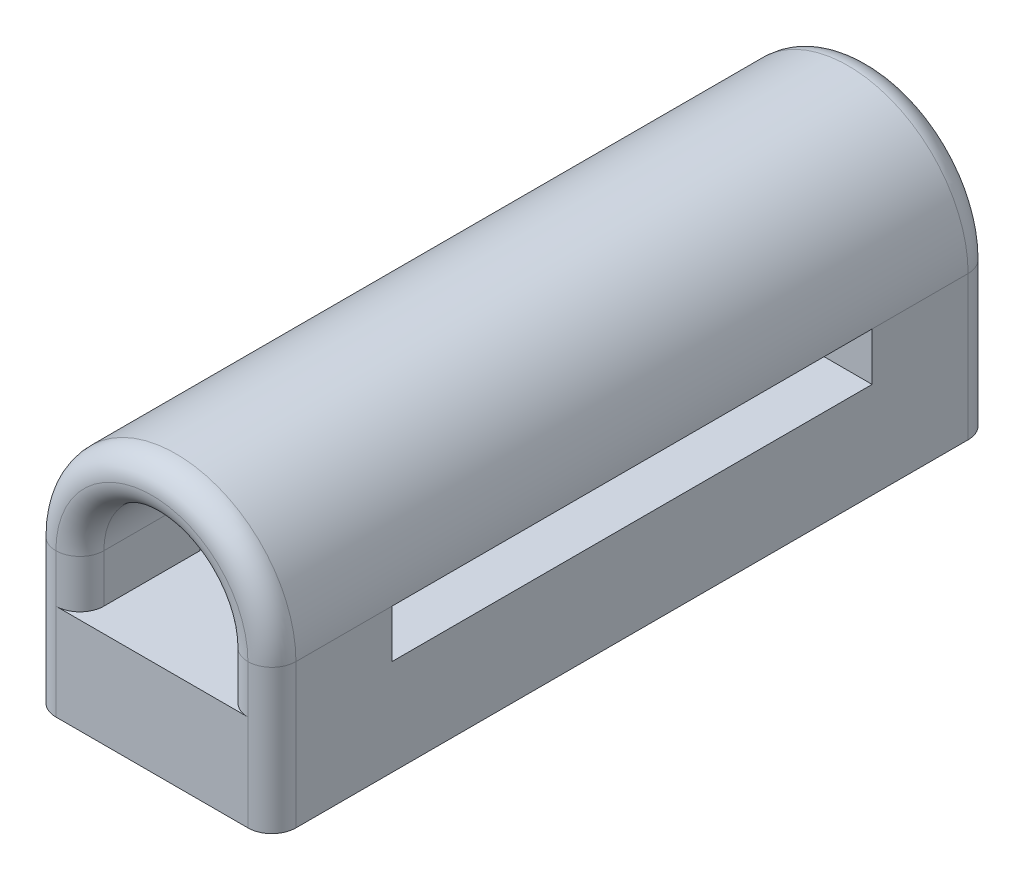
ISO-10303-21;
HEADER;
FILE_DESCRIPTION(('STEP AP214'),'2;1');
FILE_NAME('part.step','',(''),(''),'','','');
FILE_SCHEMA(('AUTOMOTIVE_DESIGN { 1 0 10303 214 1 1 1 1 }'));
ENDSEC;
DATA;
#1=APPLICATION_CONTEXT('core data for automotive mechanical design processes');
#2=APPLICATION_PROTOCOL_DEFINITION('international standard','automotive_design',2000,#1);
#3=PRODUCT_CONTEXT('',#1,'mechanical');
#4=PRODUCT('Part','Part','',(#3));
#5=PRODUCT_RELATED_PRODUCT_CATEGORY('part','',(#4));
#6=PRODUCT_DEFINITION_FORMATION('','',#4);
#7=PRODUCT_DEFINITION_CONTEXT('part definition',#1,'design');
#8=PRODUCT_DEFINITION('design','',#6,#7);
#9=PRODUCT_DEFINITION_SHAPE('','',#8);
#10=(LENGTH_UNIT() NAMED_UNIT(*) SI_UNIT(.MILLI.,.METRE.));
#11=(NAMED_UNIT(*) PLANE_ANGLE_UNIT() SI_UNIT($,.RADIAN.));
#12=(NAMED_UNIT(*) SI_UNIT($,.STERADIAN.) SOLID_ANGLE_UNIT());
#13=UNCERTAINTY_MEASURE_WITH_UNIT(LENGTH_MEASURE(1.E-05),#10,'distance_accuracy_value','');
#14=(GEOMETRIC_REPRESENTATION_CONTEXT(3) GLOBAL_UNCERTAINTY_ASSIGNED_CONTEXT((#13)) GLOBAL_UNIT_ASSIGNED_CONTEXT((#10,
#11,#12)) REPRESENTATION_CONTEXT('',''));
#15=CARTESIAN_POINT('',(0.,0.,0.));
#16=DIRECTION('',(0.,0.,1.));
#17=DIRECTION('',(1.,0.,0.));
#18=AXIS2_PLACEMENT_3D('',#15,#16,#17);
#19=CARTESIAN_POINT('',(-1.5,-3.,15.));
#20=DIRECTION('',(-1.,0.,0.));
#21=DIRECTION('',(0.,0.,1.));
#22=AXIS2_PLACEMENT_3D('',#19,#20,#21);
#23=PLANE('',#22);
#24=DIRECTION('',(0.,0.,1.));
#25=VECTOR('',#24,1.);
#26=CARTESIAN_POINT('',(-1.5,-1.,15.));
#27=LINE('',#26,#25);
#28=CARTESIAN_POINT('',(-1.5,-1.,0.5));
#29=VERTEX_POINT('',#28);
#30=CARTESIAN_POINT('',(-1.5,-1.,2.5));
#31=VERTEX_POINT('',#30);
#32=EDGE_CURVE('E162',#29,#31,#27,.T.);
#33=ORIENTED_EDGE('',*,*,#32,.F.);
#34=DIRECTION('',(0.,1.,0.));
#35=VECTOR('',#34,1.);
#36=CARTESIAN_POINT('',(-1.5,-3.,0.5));
#37=LINE('',#36,#35);
#38=CARTESIAN_POINT('',(-1.5,0.,0.5));
#39=VERTEX_POINT('',#38);
#40=EDGE_CURVE('E358',#29,#39,#37,.T.);
#41=ORIENTED_EDGE('',*,*,#40,.T.);
#42=DIRECTION('',(0.,0.,1.));
#43=VECTOR('',#42,1.);
#44=CARTESIAN_POINT('',(-1.5,0.,0.));
#45=LINE('',#44,#43);
#46=CARTESIAN_POINT('',(-1.5,0.,2.5));
#47=VERTEX_POINT('',#46);
#48=EDGE_CURVE('E207',#39,#47,#45,.T.);
#49=ORIENTED_EDGE('',*,*,#48,.T.);
#50=DIRECTION('',(0.,1.,0.));
#51=VECTOR('',#50,1.);
#52=CARTESIAN_POINT('',(-1.5,-3.,2.5));
#53=LINE('',#52,#51);
#54=EDGE_CURVE('E219',#31,#47,#53,.T.);
#55=ORIENTED_EDGE('',*,*,#54,.F.);
#56=EDGE_LOOP('',(#33,#41,#49,#55));
#57=FACE_BOUND('',#56,.T.);
#58=ADVANCED_FACE('F41',(#57),#23,.F.);
#59=DIRECTION('',(0.,0.,-1.));
#60=VECTOR('',#59,1.);
#61=CARTESIAN_POINT('',(-1.5,0.,15.));
#62=LINE('',#61,#60);
#63=CARTESIAN_POINT('',(-1.5,0.,14.5));
#64=VERTEX_POINT('',#63);
#65=CARTESIAN_POINT('',(-1.5,0.,12.5));
#66=VERTEX_POINT('',#65);
#67=EDGE_CURVE('E300',#64,#66,#62,.T.);
#68=ORIENTED_EDGE('',*,*,#67,.F.);
#69=DIRECTION('',(0.,1.,0.));
#70=VECTOR('',#69,1.);
#71=CARTESIAN_POINT('',(-1.5,-1.,14.5));
#72=LINE('',#71,#70);
#73=CARTESIAN_POINT('',(-1.5,-1.,14.5));
#74=VERTEX_POINT('',#73);
#75=EDGE_CURVE('E366',#64,#74,#72,.F.);
#76=ORIENTED_EDGE('',*,*,#75,.T.);
#77=CARTESIAN_POINT('',(-1.5,-1.,12.5));
#78=VERTEX_POINT('',#77);
#79=EDGE_CURVE('E158',#78,#74,#27,.T.);
#80=ORIENTED_EDGE('',*,*,#79,.F.);
#81=DIRECTION('',(0.,1.,0.));
#82=VECTOR('',#81,1.);
#83=CARTESIAN_POINT('',(-1.5,-3.,12.5));
#84=LINE('',#83,#82);
#85=EDGE_CURVE('E275',#78,#66,#84,.T.);
#86=ORIENTED_EDGE('',*,*,#85,.T.);
#87=EDGE_LOOP('',(#68,#76,#80,#86));
#88=FACE_BOUND('',#87,.T.);
#89=ADVANCED_FACE('F485',(#88),#23,.F.);
#90=CARTESIAN_POINT('',(1.5,-3.,15.));
#91=DIRECTION('',(1.,0.,0.));
#92=DIRECTION('',(0.,0.,-1.));
#93=AXIS2_PLACEMENT_3D('',#90,#91,#92);
#94=PLANE('',#93);
#95=DIRECTION('',(0.,0.,1.));
#96=VECTOR('',#95,1.);
#97=CARTESIAN_POINT('',(1.5,-1.,15.));
#98=LINE('',#97,#96);
#99=CARTESIAN_POINT('',(1.5,-1.,12.5));
#100=VERTEX_POINT('',#99);
#101=CARTESIAN_POINT('',(1.5,-1.,14.5));
#102=VERTEX_POINT('',#101);
#103=EDGE_CURVE('E166',#100,#102,#98,.T.);
#104=ORIENTED_EDGE('',*,*,#103,.T.);
#105=DIRECTION('',(0.,1.,0.));
#106=VECTOR('',#105,1.);
#107=CARTESIAN_POINT('',(1.5,0.,14.5));
#108=LINE('',#107,#106);
#109=CARTESIAN_POINT('',(1.5,0.,14.5));
#110=VERTEX_POINT('',#109);
#111=EDGE_CURVE('E61',#102,#110,#108,.T.);
#112=ORIENTED_EDGE('',*,*,#111,.T.);
#113=DIRECTION('',(0.,0.,-1.));
#114=VECTOR('',#113,1.);
#115=CARTESIAN_POINT('',(1.5,0.,15.));
#116=LINE('',#115,#114);
#117=CARTESIAN_POINT('',(1.5,0.,12.5));
#118=VERTEX_POINT('',#117);
#119=EDGE_CURVE('E294',#110,#118,#116,.T.);
#120=ORIENTED_EDGE('',*,*,#119,.T.);
#121=DIRECTION('',(0.,1.,0.));
#122=VECTOR('',#121,1.);
#123=CARTESIAN_POINT('',(1.5,-3.,12.5));
#124=LINE('',#123,#122);
#125=EDGE_CURVE('E259',#100,#118,#124,.T.);
#126=ORIENTED_EDGE('',*,*,#125,.F.);
#127=EDGE_LOOP('',(#104,#112,#120,#126));
#128=FACE_BOUND('',#127,.T.);
#129=ADVANCED_FACE('F522',(#128),#94,.F.);
#130=DIRECTION('',(0.,0.,-1.));
#131=VECTOR('',#130,1.);
#132=CARTESIAN_POINT('',(1.5,0.,0.));
#133=LINE('',#132,#131);
#134=CARTESIAN_POINT('',(1.5,0.,2.5));
#135=VERTEX_POINT('',#134);
#136=CARTESIAN_POINT('',(1.5,0.,0.5));
#137=VERTEX_POINT('',#136);
#138=EDGE_CURVE('E231',#135,#137,#133,.T.);
#139=ORIENTED_EDGE('',*,*,#138,.T.);
#140=DIRECTION('',(0.,1.,0.));
#141=VECTOR('',#140,1.);
#142=CARTESIAN_POINT('',(1.5,-3.,0.5));
#143=LINE('',#142,#141);
#144=CARTESIAN_POINT('',(1.5,-1.,0.5));
#145=VERTEX_POINT('',#144);
#146=EDGE_CURVE('E362',#137,#145,#143,.F.);
#147=ORIENTED_EDGE('',*,*,#146,.T.);
#148=CARTESIAN_POINT('',(1.5,-1.,2.5));
#149=VERTEX_POINT('',#148);
#150=EDGE_CURVE('E168',#145,#149,#98,.T.);
#151=ORIENTED_EDGE('',*,*,#150,.T.);
#152=DIRECTION('',(0.,1.,0.));
#153=VECTOR('',#152,1.);
#154=CARTESIAN_POINT('',(1.5,-3.,2.5));
#155=LINE('',#154,#153);
#156=EDGE_CURVE('E239',#149,#135,#155,.T.);
#157=ORIENTED_EDGE('',*,*,#156,.T.);
#158=EDGE_LOOP('',(#139,#147,#151,#157));
#159=FACE_BOUND('',#158,.T.);
#160=ADVANCED_FACE('F567',(#159),#94,.F.);
#161=CARTESIAN_POINT('',(2.5,-3.,12.5));
#162=DIRECTION('',(0.,0.,1.));
#163=DIRECTION('',(1.,0.,0.));
#164=AXIS2_PLACEMENT_3D('',#161,#162,#163);
#165=PLANE('',#164);
#166=DIRECTION('',(1.,0.,0.));
#167=VECTOR('',#166,1.);
#168=CARTESIAN_POINT('',(1.5,-1.,12.5));
#169=LINE('',#168,#167);
#170=CARTESIAN_POINT('',(2.5,-1.,12.5));
#171=VERTEX_POINT('',#170);
#172=EDGE_CURVE('E179',#100,#171,#169,.T.);
#173=ORIENTED_EDGE('',*,*,#172,.F.);
#174=ORIENTED_EDGE('',*,*,#125,.T.);
#175=DIRECTION('',(1.,0.,0.));
#176=VECTOR('',#175,1.);
#177=CARTESIAN_POINT('',(2.5,0.,12.5));
#178=LINE('',#177,#176);
#179=CARTESIAN_POINT('',(2.5,0.,12.5));
#180=VERTEX_POINT('',#179);
#181=EDGE_CURVE('E247',#118,#180,#178,.T.);
#182=ORIENTED_EDGE('',*,*,#181,.T.);
#183=DIRECTION('',(0.,1.,0.));
#184=VECTOR('',#183,1.);
#185=CARTESIAN_POINT('',(2.5,-3.,12.5));
#186=LINE('',#185,#184);
#187=EDGE_CURVE('E255',#171,#180,#186,.T.);
#188=ORIENTED_EDGE('',*,*,#187,.F.);
#189=EDGE_LOOP('',(#173,#174,#182,#188));
#190=FACE_BOUND('',#189,.T.);
#191=ADVANCED_FACE('F527',(#190),#165,.F.);
#192=CARTESIAN_POINT('',(2.5,-3.,2.5));
#193=DIRECTION('',(0.,0.,-1.));
#194=DIRECTION('',(-1.,0.,0.));
#195=AXIS2_PLACEMENT_3D('',#192,#193,#194);
#196=PLANE('',#195);
#197=DIRECTION('',(1.,0.,0.));
#198=VECTOR('',#197,1.);
#199=CARTESIAN_POINT('',(1.5,-1.,2.5));
#200=LINE('',#199,#198);
#201=CARTESIAN_POINT('',(2.5,-1.,2.5));
#202=VERTEX_POINT('',#201);
#203=EDGE_CURVE('E183',#149,#202,#200,.T.);
#204=ORIENTED_EDGE('',*,*,#203,.T.);
#205=DIRECTION('',(0.,1.,0.));
#206=VECTOR('',#205,1.);
#207=CARTESIAN_POINT('',(2.5,-3.,2.5));
#208=LINE('',#207,#206);
#209=CARTESIAN_POINT('',(2.5,0.,2.5));
#210=VERTEX_POINT('',#209);
#211=EDGE_CURVE('E243',#202,#210,#208,.T.);
#212=ORIENTED_EDGE('',*,*,#211,.T.);
#213=DIRECTION('',(-1.,0.,0.));
#214=VECTOR('',#213,1.);
#215=CARTESIAN_POINT('',(2.5,0.,2.5));
#216=LINE('',#215,#214);
#217=EDGE_CURVE('E227',#210,#135,#216,.T.);
#218=ORIENTED_EDGE('',*,*,#217,.T.);
#219=ORIENTED_EDGE('',*,*,#156,.F.);
#220=EDGE_LOOP('',(#204,#212,#218,#219));
#221=FACE_BOUND('',#220,.T.);
#222=ADVANCED_FACE('F536',(#221),#196,.F.);
#223=CARTESIAN_POINT('',(-2.5,-3.,12.5));
#224=DIRECTION('',(0.,0.,1.));
#225=DIRECTION('',(1.,0.,0.));
#226=AXIS2_PLACEMENT_3D('',#223,#224,#225);
#227=PLANE('',#226);
#228=DIRECTION('',(1.,0.,0.));
#229=VECTOR('',#228,1.);
#230=CARTESIAN_POINT('',(-2.5,-1.,12.5));
#231=LINE('',#230,#229);
#232=CARTESIAN_POINT('',(-2.5,-1.,12.5));
#233=VERTEX_POINT('',#232);
#234=EDGE_CURVE('E191',#233,#78,#231,.T.);
#235=ORIENTED_EDGE('',*,*,#234,.F.);
#236=DIRECTION('',(0.,1.,0.));
#237=VECTOR('',#236,1.);
#238=CARTESIAN_POINT('',(-2.5,-3.,12.5));
#239=LINE('',#238,#237);
#240=CARTESIAN_POINT('',(-2.5,0.,12.5));
#241=VERTEX_POINT('',#240);
#242=EDGE_CURVE('E279',#233,#241,#239,.T.);
#243=ORIENTED_EDGE('',*,*,#242,.T.);
#244=DIRECTION('',(1.,0.,0.));
#245=VECTOR('',#244,1.);
#246=CARTESIAN_POINT('',(-2.5,0.,12.5));
#247=LINE('',#246,#245);
#248=EDGE_CURVE('E263',#241,#66,#247,.T.);
#249=ORIENTED_EDGE('',*,*,#248,.T.);
#250=ORIENTED_EDGE('',*,*,#85,.F.);
#251=EDGE_LOOP('',(#235,#243,#249,#250));
#252=FACE_BOUND('',#251,.T.);
#253=ADVANCED_FACE('F553',(#252),#227,.F.);
#254=CARTESIAN_POINT('',(-2.5,-3.,2.5));
#255=DIRECTION('',(0.,0.,-1.));
#256=DIRECTION('',(-1.,0.,0.));
#257=AXIS2_PLACEMENT_3D('',#254,#255,#256);
#258=PLANE('',#257);
#259=DIRECTION('',(1.,0.,0.));
#260=VECTOR('',#259,1.);
#261=CARTESIAN_POINT('',(-2.5,-1.,2.5));
#262=LINE('',#261,#260);
#263=CARTESIAN_POINT('',(-2.5,-1.,2.5));
#264=VERTEX_POINT('',#263);
#265=EDGE_CURVE('E195',#264,#31,#262,.T.);
#266=ORIENTED_EDGE('',*,*,#265,.T.);
#267=ORIENTED_EDGE('',*,*,#54,.T.);
#268=DIRECTION('',(-1.,0.,0.));
#269=VECTOR('',#268,1.);
#270=CARTESIAN_POINT('',(-2.5,0.,2.5));
#271=LINE('',#270,#269);
#272=CARTESIAN_POINT('',(-2.5,0.,2.5));
#273=VERTEX_POINT('',#272);
#274=EDGE_CURVE('E211',#47,#273,#271,.T.);
#275=ORIENTED_EDGE('',*,*,#274,.T.);
#276=DIRECTION('',(0.,1.,0.));
#277=VECTOR('',#276,1.);
#278=CARTESIAN_POINT('',(-2.5,-3.,2.5));
#279=LINE('',#278,#277);
#280=EDGE_CURVE('E215',#264,#273,#279,.T.);
#281=ORIENTED_EDGE('',*,*,#280,.F.);
#282=EDGE_LOOP('',(#266,#267,#275,#281));
#283=FACE_BOUND('',#282,.T.);
#284=ADVANCED_FACE('F562',(#283),#258,.F.);
#285=CARTESIAN_POINT('',(0.,0.,15.));
#286=DIRECTION('',(0.,1.,0.));
#287=DIRECTION('',(0.,0.,1.));
#288=AXIS2_PLACEMENT_3D('',#285,#286,#287);
#289=PLANE('',#288);
#290=ORIENTED_EDGE('',*,*,#274,.F.);
#291=EDGE_CURVE('E297',#66,#47,#62,.T.);
#292=ORIENTED_EDGE('',*,*,#291,.F.);
#293=ORIENTED_EDGE('',*,*,#248,.F.);
#294=DIRECTION('',(0.,0.,-1.));
#295=VECTOR('',#294,1.);
#296=CARTESIAN_POINT('',(-2.5,0.,15.));
#297=LINE('',#296,#295);
#298=EDGE_CURVE('E304',#241,#273,#297,.T.);
#299=ORIENTED_EDGE('',*,*,#298,.T.);
#300=EDGE_LOOP('',(#290,#292,#293,#299));
#301=FACE_BOUND('',#300,.T.);
#302=ADVANCED_FACE('F559',(#301),#289,.F.);
#303=CARTESIAN_POINT('',(0.,0.,15.));
#304=DIRECTION('',(0.,1.,0.));
#305=DIRECTION('',(0.,0.,1.));
#306=AXIS2_PLACEMENT_3D('',#303,#304,#305);
#307=PLANE('',#306);
#308=ORIENTED_EDGE('',*,*,#217,.F.);
#309=DIRECTION('',(0.,0.,-1.));
#310=VECTOR('',#309,1.);
#311=CARTESIAN_POINT('',(2.5,0.,15.));
#312=LINE('',#311,#310);
#313=EDGE_CURVE('E283',#180,#210,#312,.T.);
#314=ORIENTED_EDGE('',*,*,#313,.F.);
#315=ORIENTED_EDGE('',*,*,#181,.F.);
#316=EDGE_CURVE('E291',#118,#135,#116,.T.);
#317=ORIENTED_EDGE('',*,*,#316,.T.);
#318=EDGE_LOOP('',(#308,#314,#315,#317));
#319=FACE_BOUND('',#318,.T.);
#320=ADVANCED_FACE('F428',(#319),#307,.F.);
#321=CARTESIAN_POINT('',(0.,0.,15.));
#322=DIRECTION('',(0.,0.,-1.));
#323=DIRECTION('',(-1.,0.,0.));
#324=AXIS2_PLACEMENT_3D('',#321,#322,#323);
#325=CYLINDRICAL_SURFACE('',#324,2.5);
#326=CARTESIAN_POINT('',(-2.5,0.,14.5));
#327=VERTEX_POINT('',#326);
#328=EDGE_CURVE('E307',#327,#241,#297,.T.);
#329=ORIENTED_EDGE('',*,*,#328,.F.);
#330=CARTESIAN_POINT('',(0.,0.,14.5));
#331=DIRECTION('',(0.,0.,1.));
#332=DIRECTION('',(1.,0.,0.));
#333=AXIS2_PLACEMENT_3D('',#330,#331,#332);
#334=CIRCLE('',#333,2.5);
#335=CARTESIAN_POINT('',(2.5,0.,14.5));
#336=VERTEX_POINT('',#335);
#337=EDGE_CURVE('E346',#327,#336,#334,.F.);
#338=ORIENTED_EDGE('',*,*,#337,.T.);
#339=EDGE_CURVE('E287',#336,#180,#312,.T.);
#340=ORIENTED_EDGE('',*,*,#339,.T.);
#341=ORIENTED_EDGE('',*,*,#313,.T.);
#342=DIRECTION('',(0.,0.,1.));
#343=VECTOR('',#342,1.);
#344=CARTESIAN_POINT('',(2.5,0.,0.));
#345=LINE('',#344,#343);
#346=CARTESIAN_POINT('',(2.5,0.,0.5));
#347=VERTEX_POINT('',#346);
#348=EDGE_CURVE('E223',#347,#210,#345,.T.);
#349=ORIENTED_EDGE('',*,*,#348,.F.);
#350=CARTESIAN_POINT('',(0.,0.,0.5));
#351=DIRECTION('',(0.,0.,1.));
#352=DIRECTION('',(1.,0.,0.));
#353=AXIS2_PLACEMENT_3D('',#350,#351,#352);
#354=CIRCLE('',#353,2.5);
#355=CARTESIAN_POINT('',(-2.5,0.,0.5));
#356=VERTEX_POINT('',#355);
#357=EDGE_CURVE('E342',#347,#356,#354,.T.);
#358=ORIENTED_EDGE('',*,*,#357,.T.);
#359=DIRECTION('',(0.,0.,-1.));
#360=VECTOR('',#359,1.);
#361=CARTESIAN_POINT('',(-2.5,0.,0.));
#362=LINE('',#361,#360);
#363=EDGE_CURVE('E203',#273,#356,#362,.T.);
#364=ORIENTED_EDGE('',*,*,#363,.F.);
#365=ORIENTED_EDGE('',*,*,#298,.F.);
#366=EDGE_LOOP('',(#329,#338,#340,#341,#349,#358,#364,#365));
#367=FACE_BOUND('',#366,.T.);
#368=ADVANCED_FACE('F419',(#367),#325,.T.);
#369=CARTESIAN_POINT('',(0.,0.,15.));
#370=DIRECTION('',(0.,0.,-1.));
#371=DIRECTION('',(-1.,0.,0.));
#372=AXIS2_PLACEMENT_3D('',#369,#370,#371);
#373=CYLINDRICAL_SURFACE('',#372,1.5);
#374=ORIENTED_EDGE('',*,*,#48,.F.);
#375=CARTESIAN_POINT('',(0.,0.,0.5));
#376=DIRECTION('',(0.,0.,1.));
#377=DIRECTION('',(1.,0.,0.));
#378=AXIS2_PLACEMENT_3D('',#375,#376,#377);
#379=CIRCLE('',#378,1.5);
#380=EDGE_CURVE('E105',#39,#137,#379,.F.);
#381=ORIENTED_EDGE('',*,*,#380,.T.);
#382=ORIENTED_EDGE('',*,*,#138,.F.);
#383=ORIENTED_EDGE('',*,*,#316,.F.);
#384=ORIENTED_EDGE('',*,*,#119,.F.);
#385=CARTESIAN_POINT('',(0.,0.,14.5));
#386=DIRECTION('',(0.,0.,1.));
#387=DIRECTION('',(1.,0.,0.));
#388=AXIS2_PLACEMENT_3D('',#385,#386,#387);
#389=CIRCLE('',#388,1.5);
#390=EDGE_CURVE('E378',#110,#64,#389,.T.);
#391=ORIENTED_EDGE('',*,*,#390,.T.);
#392=ORIENTED_EDGE('',*,*,#67,.T.);
#393=ORIENTED_EDGE('',*,*,#291,.T.);
#394=EDGE_LOOP('',(#374,#381,#382,#383,#384,#391,#392,#393));
#395=FACE_BOUND('',#394,.T.);
#396=ADVANCED_FACE('F481',(#395),#373,.F.);
#397=CARTESIAN_POINT('',(0.,0.,15.));
#398=DIRECTION('',(0.,0.,1.));
#399=DIRECTION('',(1.,0.,0.));
#400=AXIS2_PLACEMENT_3D('',#397,#398,#399);
#401=PLANE('',#400);
#402=DIRECTION('',(-1.,0.,0.));
#403=VECTOR('',#402,1.);
#404=CARTESIAN_POINT('',(-2.5,-3.,15.));
#405=LINE('',#404,#403);
#406=CARTESIAN_POINT('',(2.,-3.,15.));
#407=VERTEX_POINT('',#406);
#408=CARTESIAN_POINT('',(-2.,-3.,15.));
#409=VERTEX_POINT('',#408);
#410=EDGE_CURVE('E271',#407,#409,#405,.T.);
#411=ORIENTED_EDGE('',*,*,#410,.F.);
#412=DIRECTION('',(0.,1.,0.));
#413=VECTOR('',#412,1.);
#414=CARTESIAN_POINT('',(2.,0.,15.));
#415=LINE('',#414,#413);
#416=CARTESIAN_POINT('',(2.,-1.,15.));
#417=VERTEX_POINT('',#416);
#418=EDGE_CURVE('E314',#407,#417,#415,.T.);
#419=ORIENTED_EDGE('',*,*,#418,.T.);
#420=DIRECTION('',(-1.,0.,0.));
#421=VECTOR('',#420,1.);
#422=CARTESIAN_POINT('',(1.5,-1.,15.));
#423=LINE('',#422,#421);
#424=CARTESIAN_POINT('',(-2.,-1.,15.));
#425=VERTEX_POINT('',#424);
#426=EDGE_CURVE('E172',#417,#425,#423,.T.);
#427=ORIENTED_EDGE('',*,*,#426,.T.);
#428=DIRECTION('',(0.,1.,0.));
#429=VECTOR('',#428,1.);
#430=CARTESIAN_POINT('',(-2.,-3.,15.));
#431=LINE('',#430,#429);
#432=EDGE_CURVE('E311',#425,#409,#431,.F.);
#433=ORIENTED_EDGE('',*,*,#432,.T.);
#434=EDGE_LOOP('',(#411,#419,#427,#433));
#435=FACE_BOUND('',#434,.T.);
#436=ADVANCED_FACE('F505',(#435),#401,.T.);
#437=CARTESIAN_POINT('',(0.,0.,0.));
#438=DIRECTION('',(0.,0.,1.));
#439=DIRECTION('',(1.,0.,0.));
#440=AXIS2_PLACEMENT_3D('',#437,#438,#439);
#441=PLANE('',#440);
#442=DIRECTION('',(-1.,0.,0.));
#443=VECTOR('',#442,1.);
#444=CARTESIAN_POINT('',(1.5,-1.,0.));
#445=LINE('',#444,#443);
#446=CARTESIAN_POINT('',(2.,-1.,0.));
#447=VERTEX_POINT('',#446);
#448=CARTESIAN_POINT('',(-2.,-1.,0.));
#449=VERTEX_POINT('',#448);
#450=EDGE_CURVE('E175',#447,#449,#445,.T.);
#451=ORIENTED_EDGE('',*,*,#450,.F.);
#452=DIRECTION('',(0.,1.,0.));
#453=VECTOR('',#452,1.);
#454=CARTESIAN_POINT('',(2.,0.,0.));
#455=LINE('',#454,#453);
#456=CARTESIAN_POINT('',(2.,-3.,0.));
#457=VERTEX_POINT('',#456);
#458=EDGE_CURVE('E354',#447,#457,#455,.F.);
#459=ORIENTED_EDGE('',*,*,#458,.T.);
#460=DIRECTION('',(1.,0.,0.));
#461=VECTOR('',#460,1.);
#462=CARTESIAN_POINT('',(2.5,-3.,0.));
#463=LINE('',#462,#461);
#464=CARTESIAN_POINT('',(-2.,-3.,0.));
#465=VERTEX_POINT('',#464);
#466=EDGE_CURVE('E235',#465,#457,#463,.T.);
#467=ORIENTED_EDGE('',*,*,#466,.F.);
#468=DIRECTION('',(0.,1.,0.));
#469=VECTOR('',#468,1.);
#470=CARTESIAN_POINT('',(-2.,0.,0.));
#471=LINE('',#470,#469);
#472=EDGE_CURVE('E350',#465,#449,#471,.T.);
#473=ORIENTED_EDGE('',*,*,#472,.T.);
#474=EDGE_LOOP('',(#451,#459,#467,#473));
#475=FACE_BOUND('',#474,.T.);
#476=ADVANCED_FACE('F571',(#475),#441,.F.);
#477=CARTESIAN_POINT('',(-2.5,-3.,15.));
#478=DIRECTION('',(1.,0.,0.));
#479=DIRECTION('',(0.,0.,-1.));
#480=AXIS2_PLACEMENT_3D('',#477,#478,#479);
#481=PLANE('',#480);
#482=DIRECTION('',(0.,0.,-1.));
#483=VECTOR('',#482,1.);
#484=CARTESIAN_POINT('',(-2.5,-3.,15.));
#485=LINE('',#484,#483);
#486=CARTESIAN_POINT('',(-2.5,-3.,14.5));
#487=VERTEX_POINT('',#486);
#488=CARTESIAN_POINT('',(-2.5,-3.,0.5));
#489=VERTEX_POINT('',#488);
#490=EDGE_CURVE('E267',#487,#489,#485,.T.);
#491=ORIENTED_EDGE('',*,*,#490,.F.);
#492=DIRECTION('',(0.,1.,0.));
#493=VECTOR('',#492,1.);
#494=CARTESIAN_POINT('',(-2.5,0.,14.5));
#495=LINE('',#494,#493);
#496=EDGE_CURVE('E374',#487,#327,#495,.T.);
#497=ORIENTED_EDGE('',*,*,#496,.T.);
#498=ORIENTED_EDGE('',*,*,#328,.T.);
#499=ORIENTED_EDGE('',*,*,#242,.F.);
#500=DIRECTION('',(0.,0.,1.));
#501=VECTOR('',#500,1.);
#502=CARTESIAN_POINT('',(-2.5,-1.,2.5));
#503=LINE('',#502,#501);
#504=EDGE_CURVE('E199',#264,#233,#503,.T.);
#505=ORIENTED_EDGE('',*,*,#504,.F.);
#506=ORIENTED_EDGE('',*,*,#280,.T.);
#507=ORIENTED_EDGE('',*,*,#363,.T.);
#508=DIRECTION('',(0.,1.,0.));
#509=VECTOR('',#508,1.);
#510=CARTESIAN_POINT('',(-2.5,-3.,0.5));
#511=LINE('',#510,#509);
#512=EDGE_CURVE('E114',#356,#489,#511,.F.);
#513=ORIENTED_EDGE('',*,*,#512,.T.);
#514=EDGE_LOOP('',(#491,#497,#498,#499,#505,#506,#507,#513));
#515=FACE_BOUND('',#514,.T.);
#516=ADVANCED_FACE('F555',(#515),#481,.F.);
#517=CARTESIAN_POINT('',(0.,-3.,0.));
#518=DIRECTION('',(0.,-1.,0.));
#519=DIRECTION('',(0.,0.,-1.));
#520=AXIS2_PLACEMENT_3D('',#517,#518,#519);
#521=PLANE('',#520);
#522=DIRECTION('',(0.,0.,1.));
#523=VECTOR('',#522,1.);
#524=CARTESIAN_POINT('',(2.5,-3.,15.));
#525=LINE('',#524,#523);
#526=CARTESIAN_POINT('',(2.5,-3.,0.5));
#527=VERTEX_POINT('',#526);
#528=CARTESIAN_POINT('',(2.5,-3.,14.5));
#529=VERTEX_POINT('',#528);
#530=EDGE_CURVE('E251',#527,#529,#525,.T.);
#531=ORIENTED_EDGE('',*,*,#530,.T.);
#532=CARTESIAN_POINT('',(2.,-3.,14.5));
#533=DIRECTION('',(0.,-1.,0.));
#534=DIRECTION('',(0.,0.,-1.));
#535=AXIS2_PLACEMENT_3D('',#532,#533,#534);
#536=CIRCLE('',#535,0.5);
#537=EDGE_CURVE('E338',#529,#407,#536,.T.);
#538=ORIENTED_EDGE('',*,*,#537,.T.);
#539=ORIENTED_EDGE('',*,*,#410,.T.);
#540=CARTESIAN_POINT('',(-2.,-3.,14.5));
#541=DIRECTION('',(0.,-1.,0.));
#542=DIRECTION('',(0.,0.,-1.));
#543=AXIS2_PLACEMENT_3D('',#540,#541,#542);
#544=CIRCLE('',#543,0.5);
#545=EDGE_CURVE('E330',#409,#487,#544,.T.);
#546=ORIENTED_EDGE('',*,*,#545,.T.);
#547=ORIENTED_EDGE('',*,*,#490,.T.);
#548=CARTESIAN_POINT('',(-2.,-3.,0.5));
#549=DIRECTION('',(0.,-1.,0.));
#550=DIRECTION('',(0.,0.,-1.));
#551=AXIS2_PLACEMENT_3D('',#548,#549,#550);
#552=CIRCLE('',#551,0.5);
#553=EDGE_CURVE('E326',#489,#465,#552,.T.);
#554=ORIENTED_EDGE('',*,*,#553,.T.);
#555=ORIENTED_EDGE('',*,*,#466,.T.);
#556=CARTESIAN_POINT('',(2.,-3.,0.5));
#557=DIRECTION('',(0.,-1.,0.));
#558=DIRECTION('',(0.,0.,-1.));
#559=AXIS2_PLACEMENT_3D('',#556,#557,#558);
#560=CIRCLE('',#559,0.5);
#561=EDGE_CURVE('E334',#457,#527,#560,.T.);
#562=ORIENTED_EDGE('',*,*,#561,.T.);
#563=EDGE_LOOP('',(#531,#538,#539,#546,#547,#554,#555,#562));
#564=FACE_BOUND('',#563,.T.);
#565=ADVANCED_FACE('F508',(#564),#521,.T.);
#566=CARTESIAN_POINT('',(2.5,-3.,15.));
#567=DIRECTION('',(-1.,0.,0.));
#568=DIRECTION('',(0.,0.,1.));
#569=AXIS2_PLACEMENT_3D('',#566,#567,#568);
#570=PLANE('',#569);
#571=ORIENTED_EDGE('',*,*,#339,.F.);
#572=DIRECTION('',(0.,1.,0.));
#573=VECTOR('',#572,1.);
#574=CARTESIAN_POINT('',(2.5,-3.,14.5));
#575=LINE('',#574,#573);
#576=EDGE_CURVE('E322',#336,#529,#575,.F.);
#577=ORIENTED_EDGE('',*,*,#576,.T.);
#578=ORIENTED_EDGE('',*,*,#530,.F.);
#579=DIRECTION('',(0.,1.,0.));
#580=VECTOR('',#579,1.);
#581=CARTESIAN_POINT('',(2.5,-3.,0.5));
#582=LINE('',#581,#580);
#583=EDGE_CURVE('E318',#527,#347,#582,.T.);
#584=ORIENTED_EDGE('',*,*,#583,.T.);
#585=ORIENTED_EDGE('',*,*,#348,.T.);
#586=ORIENTED_EDGE('',*,*,#211,.F.);
#587=DIRECTION('',(0.,0.,1.));
#588=VECTOR('',#587,1.);
#589=CARTESIAN_POINT('',(2.5,-1.,2.5));
#590=LINE('',#589,#588);
#591=EDGE_CURVE('E187',#202,#171,#590,.T.);
#592=ORIENTED_EDGE('',*,*,#591,.T.);
#593=ORIENTED_EDGE('',*,*,#187,.T.);
#594=EDGE_LOOP('',(#571,#577,#578,#584,#585,#586,#592,#593));
#595=FACE_BOUND('',#594,.T.);
#596=ADVANCED_FACE('F415',(#595),#570,.F.);
#597=CARTESIAN_POINT('',(-2.5,-1.,2.5));
#598=DIRECTION('',(0.,-1.,0.));
#599=DIRECTION('',(0.,0.,-1.));
#600=AXIS2_PLACEMENT_3D('',#597,#598,#599);
#601=PLANE('',#600);
#602=ORIENTED_EDGE('',*,*,#234,.T.);
#603=ORIENTED_EDGE('',*,*,#79,.T.);
#604=CARTESIAN_POINT('',(-2.,-1.,14.5));
#605=DIRECTION('',(0.,-1.,0.));
#606=DIRECTION('',(0.,0.,-1.));
#607=AXIS2_PLACEMENT_3D('',#604,#605,#606);
#608=CIRCLE('',#607,0.5);
#609=EDGE_CURVE('E52',#74,#425,#608,.T.);
#610=ORIENTED_EDGE('',*,*,#609,.T.);
#611=ORIENTED_EDGE('',*,*,#426,.F.);
#612=CARTESIAN_POINT('',(2.,-1.,14.5));
#613=DIRECTION('',(0.,-1.,0.));
#614=DIRECTION('',(0.,0.,-1.));
#615=AXIS2_PLACEMENT_3D('',#612,#613,#614);
#616=CIRCLE('',#615,0.5);
#617=EDGE_CURVE('E11',#417,#102,#616,.T.);
#618=ORIENTED_EDGE('',*,*,#617,.T.);
#619=ORIENTED_EDGE('',*,*,#103,.F.);
#620=ORIENTED_EDGE('',*,*,#172,.T.);
#621=ORIENTED_EDGE('',*,*,#591,.F.);
#622=ORIENTED_EDGE('',*,*,#203,.F.);
#623=ORIENTED_EDGE('',*,*,#150,.F.);
#624=CARTESIAN_POINT('',(2.,-1.,0.5));
#625=DIRECTION('',(0.,-1.,0.));
#626=DIRECTION('',(0.,0.,-1.));
#627=AXIS2_PLACEMENT_3D('',#624,#625,#626);
#628=CIRCLE('',#627,0.5);
#629=EDGE_CURVE('E386',#145,#447,#628,.T.);
#630=ORIENTED_EDGE('',*,*,#629,.T.);
#631=ORIENTED_EDGE('',*,*,#450,.T.);
#632=CARTESIAN_POINT('',(-2.,-1.,0.5));
#633=DIRECTION('',(0.,-1.,0.));
#634=DIRECTION('',(0.,0.,-1.));
#635=AXIS2_PLACEMENT_3D('',#632,#633,#634);
#636=CIRCLE('',#635,0.5);
#637=EDGE_CURVE('E93',#449,#29,#636,.T.);
#638=ORIENTED_EDGE('',*,*,#637,.T.);
#639=ORIENTED_EDGE('',*,*,#32,.T.);
#640=ORIENTED_EDGE('',*,*,#265,.F.);
#641=ORIENTED_EDGE('',*,*,#504,.T.);
#642=EDGE_LOOP('',(#602,#603,#610,#611,#618,#619,#620,#621,#622,#623,#630,#631,#638,#639,#640,#641));
#643=FACE_BOUND('',#642,.T.);
#644=ADVANCED_FACE('F518',(#643),#601,.F.);
#645=CARTESIAN_POINT('',(-2.,0.,14.5));
#646=DIRECTION('',(0.,-1.,0.));
#647=DIRECTION('',(0.,0.,-1.));
#648=AXIS2_PLACEMENT_3D('',#645,#646,#647);
#649=CYLINDRICAL_SURFACE('',#648,0.5);
#650=ORIENTED_EDGE('',*,*,#609,.F.);
#651=ORIENTED_EDGE('',*,*,#75,.F.);
#652=CARTESIAN_POINT('',(-2.,0.,14.5));
#653=DIRECTION('',(0.,1.,0.));
#654=DIRECTION('',(0.,0.,1.));
#655=AXIS2_PLACEMENT_3D('',#652,#653,#654);
#656=CIRCLE('',#655,0.5);
#657=CARTESIAN_POINT('',(-2.,0.,15.));
#658=VERTEX_POINT('',#657);
#659=EDGE_CURVE('E154',#658,#64,#656,.T.);
#660=ORIENTED_EDGE('',*,*,#659,.F.);
#661=DIRECTION('',(0.,1.,0.));
#662=VECTOR('',#661,1.);
#663=CARTESIAN_POINT('',(-2.,0.,15.));
#664=LINE('',#663,#662);
#665=EDGE_CURVE('E150',#425,#658,#664,.T.);
#666=ORIENTED_EDGE('',*,*,#665,.F.);
#667=EDGE_LOOP('',(#650,#651,#660,#666));
#668=FACE_BOUND('',#667,.T.);
#669=ADVANCED_FACE('F489',(#668),#649,.T.);
#670=CARTESIAN_POINT('',(0.,0.,14.5));
#671=DIRECTION('',(0.,0.,1.));
#672=DIRECTION('',(1.,0.,0.));
#673=AXIS2_PLACEMENT_3D('',#670,#671,#672);
#674=TOROIDAL_SURFACE('',#673,2.,0.5);
#675=ORIENTED_EDGE('',*,*,#659,.T.);
#676=ORIENTED_EDGE('',*,*,#390,.F.);
#677=CARTESIAN_POINT('',(2.,0.,14.5));
#678=DIRECTION('',(0.,-1.,0.));
#679=DIRECTION('',(0.,0.,-1.));
#680=AXIS2_PLACEMENT_3D('',#677,#678,#679);
#681=CIRCLE('',#680,0.5);
#682=CARTESIAN_POINT('',(2.,0.,15.));
#683=VERTEX_POINT('',#682);
#684=EDGE_CURVE('E146',#683,#110,#681,.T.);
#685=ORIENTED_EDGE('',*,*,#684,.F.);
#686=CARTESIAN_POINT('',(0.,0.,15.));
#687=DIRECTION('',(0.,0.,1.));
#688=DIRECTION('',(1.,0.,0.));
#689=AXIS2_PLACEMENT_3D('',#686,#687,#688);
#690=CIRCLE('',#689,2.);
#691=EDGE_CURVE('E142',#658,#683,#690,.F.);
#692=ORIENTED_EDGE('',*,*,#691,.F.);
#693=EDGE_LOOP('',(#675,#676,#685,#692));
#694=FACE_BOUND('',#693,.T.);
#695=ADVANCED_FACE('F491',(#694),#674,.T.);
#696=CARTESIAN_POINT('',(-2.,-3.,14.5));
#697=DIRECTION('',(0.,-1.,0.));
#698=DIRECTION('',(0.,0.,-1.));
#699=AXIS2_PLACEMENT_3D('',#696,#697,#698);
#700=CYLINDRICAL_SURFACE('',#699,0.5);
#701=ORIENTED_EDGE('',*,*,#432,.F.);
#702=ORIENTED_EDGE('',*,*,#665,.T.);
#703=CARTESIAN_POINT('',(-2.,0.,14.5));
#704=DIRECTION('',(0.,1.,0.));
#705=DIRECTION('',(0.,0.,1.));
#706=AXIS2_PLACEMENT_3D('',#703,#704,#705);
#707=CIRCLE('',#706,0.5);
#708=EDGE_CURVE('E138',#327,#658,#707,.T.);
#709=ORIENTED_EDGE('',*,*,#708,.F.);
#710=ORIENTED_EDGE('',*,*,#496,.F.);
#711=ORIENTED_EDGE('',*,*,#545,.F.);
#712=EDGE_LOOP('',(#701,#702,#709,#710,#711));
#713=FACE_BOUND('',#712,.T.);
#714=ADVANCED_FACE('F501',(#713),#700,.T.);
#715=CARTESIAN_POINT('',(2.,-3.,14.5));
#716=DIRECTION('',(0.,-1.,0.));
#717=DIRECTION('',(0.,0.,-1.));
#718=AXIS2_PLACEMENT_3D('',#715,#716,#717);
#719=CYLINDRICAL_SURFACE('',#718,0.5);
#720=ORIENTED_EDGE('',*,*,#111,.F.);
#721=ORIENTED_EDGE('',*,*,#617,.F.);
#722=DIRECTION('',(0.,1.,0.));
#723=VECTOR('',#722,1.);
#724=CARTESIAN_POINT('',(2.,-1.,15.));
#725=LINE('',#724,#723);
#726=EDGE_CURVE('E134',#683,#417,#725,.F.);
#727=ORIENTED_EDGE('',*,*,#726,.F.);
#728=ORIENTED_EDGE('',*,*,#684,.T.);
#729=EDGE_LOOP('',(#720,#721,#727,#728));
#730=FACE_BOUND('',#729,.T.);
#731=ADVANCED_FACE('F516',(#730),#719,.T.);
#732=CARTESIAN_POINT('',(0.,0.,14.5));
#733=DIRECTION('',(0.,0.,1.));
#734=DIRECTION('',(1.,0.,0.));
#735=AXIS2_PLACEMENT_3D('',#732,#733,#734);
#736=TOROIDAL_SURFACE('',#735,2.,0.5);
#737=ORIENTED_EDGE('',*,*,#708,.T.);
#738=ORIENTED_EDGE('',*,*,#691,.T.);
#739=CARTESIAN_POINT('',(2.,0.,14.5));
#740=DIRECTION('',(0.,-1.,0.));
#741=DIRECTION('',(0.,0.,-1.));
#742=AXIS2_PLACEMENT_3D('',#739,#740,#741);
#743=CIRCLE('',#742,0.5);
#744=EDGE_CURVE('E98',#336,#683,#743,.T.);
#745=ORIENTED_EDGE('',*,*,#744,.F.);
#746=ORIENTED_EDGE('',*,*,#337,.F.);
#747=EDGE_LOOP('',(#737,#738,#745,#746));
#748=FACE_BOUND('',#747,.T.);
#749=ADVANCED_FACE('F497',(#748),#736,.T.);
#750=CARTESIAN_POINT('',(2.,0.,14.5));
#751=DIRECTION('',(0.,-1.,0.));
#752=DIRECTION('',(0.,0.,-1.));
#753=AXIS2_PLACEMENT_3D('',#750,#751,#752);
#754=CYLINDRICAL_SURFACE('',#753,0.5);
#755=ORIENTED_EDGE('',*,*,#537,.F.);
#756=ORIENTED_EDGE('',*,*,#576,.F.);
#757=ORIENTED_EDGE('',*,*,#744,.T.);
#758=ORIENTED_EDGE('',*,*,#726,.T.);
#759=ORIENTED_EDGE('',*,*,#418,.F.);
#760=EDGE_LOOP('',(#755,#756,#757,#758,#759));
#761=FACE_BOUND('',#760,.T.);
#762=ADVANCED_FACE('F513',(#761),#754,.T.);
#763=CARTESIAN_POINT('',(-2.,-3.,0.5));
#764=DIRECTION('',(0.,1.,0.));
#765=DIRECTION('',(0.,0.,1.));
#766=AXIS2_PLACEMENT_3D('',#763,#764,#765);
#767=CYLINDRICAL_SURFACE('',#766,0.5);
#768=ORIENTED_EDGE('',*,*,#40,.F.);
#769=ORIENTED_EDGE('',*,*,#637,.F.);
#770=DIRECTION('',(0.,1.,0.));
#771=VECTOR('',#770,1.);
#772=CARTESIAN_POINT('',(-2.,0.,0.));
#773=LINE('',#772,#771);
#774=CARTESIAN_POINT('',(-2.,0.,0.));
#775=VERTEX_POINT('',#774);
#776=EDGE_CURVE('E45',#775,#449,#773,.F.);
#777=ORIENTED_EDGE('',*,*,#776,.F.);
#778=CARTESIAN_POINT('',(-2.,0.,0.5));
#779=DIRECTION('',(0.,1.,0.));
#780=DIRECTION('',(0.,0.,1.));
#781=AXIS2_PLACEMENT_3D('',#778,#779,#780);
#782=CIRCLE('',#781,0.5);
#783=EDGE_CURVE('E89',#39,#775,#782,.T.);
#784=ORIENTED_EDGE('',*,*,#783,.F.);
#785=EDGE_LOOP('',(#768,#769,#777,#784));
#786=FACE_BOUND('',#785,.T.);
#787=ADVANCED_FACE('F43',(#786),#767,.T.);
#788=CARTESIAN_POINT('',(-2.,0.,0.5));
#789=DIRECTION('',(0.,1.,0.));
#790=DIRECTION('',(0.,0.,1.));
#791=AXIS2_PLACEMENT_3D('',#788,#789,#790);
#792=CYLINDRICAL_SURFACE('',#791,0.5);
#793=ORIENTED_EDGE('',*,*,#553,.F.);
#794=ORIENTED_EDGE('',*,*,#512,.F.);
#795=CARTESIAN_POINT('',(-2.,0.,0.5));
#796=DIRECTION('',(0.,1.,0.));
#797=DIRECTION('',(0.,0.,1.));
#798=AXIS2_PLACEMENT_3D('',#795,#796,#797);
#799=CIRCLE('',#798,0.5);
#800=EDGE_CURVE('E109',#775,#356,#799,.T.);
#801=ORIENTED_EDGE('',*,*,#800,.F.);
#802=ORIENTED_EDGE('',*,*,#776,.T.);
#803=ORIENTED_EDGE('',*,*,#472,.F.);
#804=EDGE_LOOP('',(#793,#794,#801,#802,#803));
#805=FACE_BOUND('',#804,.T.);
#806=ADVANCED_FACE('F111',(#805),#792,.T.);
#807=CARTESIAN_POINT('',(0.,0.,0.5));
#808=DIRECTION('',(0.,0.,1.));
#809=DIRECTION('',(1.,0.,0.));
#810=AXIS2_PLACEMENT_3D('',#807,#808,#809);
#811=TOROIDAL_SURFACE('',#810,2.,0.5);
#812=CARTESIAN_POINT('',(2.,0.,0.5));
#813=DIRECTION('',(0.,-1.,0.));
#814=DIRECTION('',(0.,0.,-1.));
#815=AXIS2_PLACEMENT_3D('',#812,#813,#814);
#816=CIRCLE('',#815,0.5);
#817=CARTESIAN_POINT('',(2.,0.,0.));
#818=VERTEX_POINT('',#817);
#819=EDGE_CURVE('E79',#137,#818,#816,.T.);
#820=ORIENTED_EDGE('',*,*,#819,.F.);
#821=ORIENTED_EDGE('',*,*,#380,.F.);
#822=ORIENTED_EDGE('',*,*,#783,.T.);
#823=CARTESIAN_POINT('',(0.,0.,0.));
#824=DIRECTION('',(0.,0.,1.));
#825=DIRECTION('',(1.,0.,0.));
#826=AXIS2_PLACEMENT_3D('',#823,#824,#825);
#827=CIRCLE('',#826,2.);
#828=EDGE_CURVE('E102',#818,#775,#827,.T.);
#829=ORIENTED_EDGE('',*,*,#828,.F.);
#830=EDGE_LOOP('',(#820,#821,#822,#829));
#831=FACE_BOUND('',#830,.T.);
#832=ADVANCED_FACE('F100',(#831),#811,.T.);
#833=CARTESIAN_POINT('',(2.,0.,0.5));
#834=DIRECTION('',(0.,1.,0.));
#835=DIRECTION('',(0.,0.,1.));
#836=AXIS2_PLACEMENT_3D('',#833,#834,#835);
#837=CYLINDRICAL_SURFACE('',#836,0.5);
#838=ORIENTED_EDGE('',*,*,#146,.F.);
#839=ORIENTED_EDGE('',*,*,#819,.T.);
#840=DIRECTION('',(0.,1.,0.));
#841=VECTOR('',#840,1.);
#842=CARTESIAN_POINT('',(2.,0.,0.));
#843=LINE('',#842,#841);
#844=EDGE_CURVE('E124',#447,#818,#843,.T.);
#845=ORIENTED_EDGE('',*,*,#844,.F.);
#846=ORIENTED_EDGE('',*,*,#629,.F.);
#847=EDGE_LOOP('',(#838,#839,#845,#846));
#848=FACE_BOUND('',#847,.T.);
#849=ADVANCED_FACE('F568',(#848),#837,.T.);
#850=CARTESIAN_POINT('',(0.,0.,0.5));
#851=DIRECTION('',(0.,0.,1.));
#852=DIRECTION('',(1.,0.,0.));
#853=AXIS2_PLACEMENT_3D('',#850,#851,#852);
#854=TOROIDAL_SURFACE('',#853,2.,0.5);
#855=ORIENTED_EDGE('',*,*,#800,.T.);
#856=ORIENTED_EDGE('',*,*,#357,.F.);
#857=CARTESIAN_POINT('',(2.,0.,0.5));
#858=DIRECTION('',(0.,-1.,0.));
#859=DIRECTION('',(0.,0.,-1.));
#860=AXIS2_PLACEMENT_3D('',#857,#858,#859);
#861=CIRCLE('',#860,0.5);
#862=EDGE_CURVE('E122',#818,#347,#861,.T.);
#863=ORIENTED_EDGE('',*,*,#862,.F.);
#864=ORIENTED_EDGE('',*,*,#828,.T.);
#865=EDGE_LOOP('',(#855,#856,#863,#864));
#866=FACE_BOUND('',#865,.T.);
#867=ADVANCED_FACE('F120',(#866),#854,.T.);
#868=CARTESIAN_POINT('',(2.,-3.,0.5));
#869=DIRECTION('',(0.,1.,0.));
#870=DIRECTION('',(0.,0.,1.));
#871=AXIS2_PLACEMENT_3D('',#868,#869,#870);
#872=CYLINDRICAL_SURFACE('',#871,0.5);
#873=ORIENTED_EDGE('',*,*,#458,.F.);
#874=ORIENTED_EDGE('',*,*,#844,.T.);
#875=ORIENTED_EDGE('',*,*,#862,.T.);
#876=ORIENTED_EDGE('',*,*,#583,.F.);
#877=ORIENTED_EDGE('',*,*,#561,.F.);
#878=EDGE_LOOP('',(#873,#874,#875,#876,#877));
#879=FACE_BOUND('',#878,.T.);
#880=ADVANCED_FACE('F403',(#879),#872,.T.);
#881=CLOSED_SHELL('',(#58,#89,#129,#160,#191,#222,#253,#284,#302,#320,#368,#396,#436,#476,#516,
#565,#596,#644,#669,#695,#714,#731,#749,#762,#787,#806,#832,#849,#867,#880));
#882=MANIFOLD_SOLID_BREP('B2',#881);
#883=ADVANCED_BREP_SHAPE_REPRESENTATION('',(#18,#882),#14);
#884=SHAPE_DEFINITION_REPRESENTATION(#9,#883);
ENDSEC;
END-ISO-10303-21;
